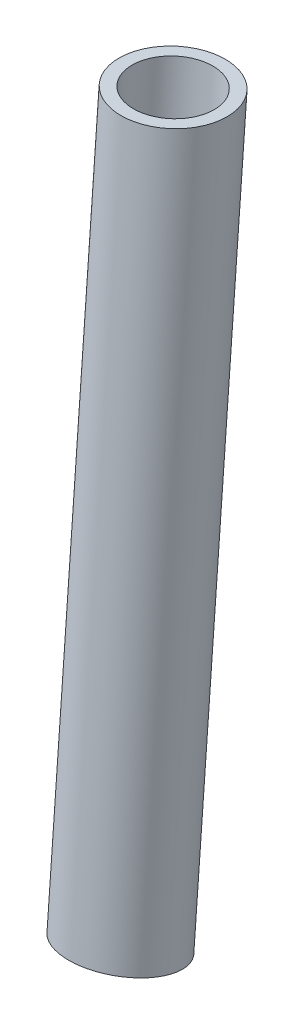
ISO-10303-21;
HEADER;
FILE_DESCRIPTION(('STEP AP214'),'2;1');
FILE_NAME('part.step','',(''),(''),'','','');
FILE_SCHEMA(('AUTOMOTIVE_DESIGN { 1 0 10303 214 1 1 1 1 }'));
ENDSEC;
DATA;
#1=APPLICATION_CONTEXT('core data for automotive mechanical design processes');
#2=APPLICATION_PROTOCOL_DEFINITION('international standard','automotive_design',2000,#1);
#3=PRODUCT_CONTEXT('',#1,'mechanical');
#4=PRODUCT('Part','Part','',(#3));
#5=PRODUCT_RELATED_PRODUCT_CATEGORY('part','',(#4));
#6=PRODUCT_DEFINITION_FORMATION('','',#4);
#7=PRODUCT_DEFINITION_CONTEXT('part definition',#1,'design');
#8=PRODUCT_DEFINITION('design','',#6,#7);
#9=PRODUCT_DEFINITION_SHAPE('','',#8);
#10=(LENGTH_UNIT() NAMED_UNIT(*) SI_UNIT(.MILLI.,.METRE.));
#11=(NAMED_UNIT(*) PLANE_ANGLE_UNIT() SI_UNIT($,.RADIAN.));
#12=(NAMED_UNIT(*) SI_UNIT($,.STERADIAN.) SOLID_ANGLE_UNIT());
#13=UNCERTAINTY_MEASURE_WITH_UNIT(LENGTH_MEASURE(1.E-05),#10,'distance_accuracy_value','');
#14=(GEOMETRIC_REPRESENTATION_CONTEXT(3) GLOBAL_UNCERTAINTY_ASSIGNED_CONTEXT((#13)) GLOBAL_UNIT_ASSIGNED_CONTEXT((#10,
#11,#12)) REPRESENTATION_CONTEXT('',''));
#15=CARTESIAN_POINT('',(0.,0.,0.));
#16=DIRECTION('',(0.,0.,1.));
#17=DIRECTION('',(1.,0.,0.));
#18=AXIS2_PLACEMENT_3D('',#15,#16,#17);
#19=CARTESIAN_POINT('',(899.196916053029,101.086343763392,-238.011921297441));
#20=DIRECTION('',(0.00459360392302388,0.9976356448477,-0.0685712690003063));
#21=DIRECTION('',(0.,0.068571992479684,0.99764617066742));
#22=AXIS2_PLACEMENT_3D('',#19,#20,#21);
#23=CYLINDRICAL_SURFACE('',#22,9.64999999999998);
#24=CARTESIAN_POINT('',(900.,275.499546279119,-249.999999999998));
#25=DIRECTION('',(-0.00229816078025706,-0.999408736415632,0.034305918339809));
#26=DIRECTION('',(0.0668008812398191,-0.0343828093108978,-0.997173738467612));
#27=AXIS2_PLACEMENT_3D('',#24,#25,#26);
#28=ELLIPSE('',#27,9.65570906915421,9.64999999999998);
#29=CARTESIAN_POINT('',(900.645009874815,275.167555875433,-259.628419510043));
#30=VERTEX_POINT('',#29);
#31=EDGE_CURVE('E47',#30,#30,#28,.T.);
#32=ORIENTED_EDGE('',*,*,#31,.F.);
#33=EDGE_LOOP('',(#32));
#34=FACE_BOUND('',#33,.T.);
#35=CARTESIAN_POINT('',(899.196916053029,101.086343763392,-238.011921297441));
#36=DIRECTION('',(0.00143638782424149,-0.977156337317368,0.212516891635755));
#37=DIRECTION('',(0.0414428460712231,0.212392700268517,0.976305193769943));
#38=AXIS2_PLACEMENT_3D('',#35,#36,#37);
#39=ELLIPSE('',#38,9.75326811540499,9.64999999999998);
#40=CARTESIAN_POINT('',(899.601119242227,103.157866714865,-228.48975498014));
#41=VERTEX_POINT('',#40);
#42=EDGE_CURVE('E42',#41,#41,#39,.T.);
#43=ORIENTED_EDGE('',*,*,#42,.T.);
#44=EDGE_LOOP('',(#43));
#45=FACE_BOUND('',#44,.T.);
#46=ADVANCED_FACE('F38',(#34,#45),#23,.F.);
#47=CARTESIAN_POINT('',(899.196916053029,101.086343763392,-238.011921297441));
#48=DIRECTION('',(0.00459360392302388,0.9976356448477,-0.0685712690003063));
#49=DIRECTION('',(0.,0.068571992479684,0.99764617066742));
#50=AXIS2_PLACEMENT_3D('',#47,#48,#49);
#51=CYLINDRICAL_SURFACE('',#50,12.7000000000001);
#52=CARTESIAN_POINT('',(900.,275.499546279119,-249.999999999998));
#53=DIRECTION('',(-0.00229816078025706,-0.999408736415632,0.034305918339809));
#54=DIRECTION('',(0.0668008812398191,-0.0343828093108978,-0.997173738467612));
#55=AXIS2_PLACEMENT_3D('',#52,#53,#54);
#56=ELLIPSE('',#55,12.7075134899751,12.7000000000001);
#57=CARTESIAN_POINT('',(900.848873099497,275.062626265978,-262.671598733424));
#58=VERTEX_POINT('',#57);
#59=EDGE_CURVE('E53',#58,#58,#56,.T.);
#60=ORIENTED_EDGE('',*,*,#59,.T.);
#61=EDGE_LOOP('',(#60));
#62=FACE_BOUND('',#61,.T.);
#63=CARTESIAN_POINT('',(899.196916053029,101.086343763392,-238.011921297441));
#64=DIRECTION('',(0.00143638782424149,-0.977156337317368,0.212516891635755));
#65=DIRECTION('',(0.0414428460712231,0.212392700268517,0.976305193769943));
#66=AXIS2_PLACEMENT_3D('',#63,#64,#65);
#67=ELLIPSE('',#66,12.8359072606885,12.7000000000001);
#68=CARTESIAN_POINT('',(899.728872581818,103.812596766886,-225.480158372081));
#69=VERTEX_POINT('',#68);
#70=EDGE_CURVE('E10',#69,#69,#67,.T.);
#71=ORIENTED_EDGE('',*,*,#70,.F.);
#72=EDGE_LOOP('',(#71));
#73=FACE_BOUND('',#72,.T.);
#74=ADVANCED_FACE('F72',(#62,#73),#51,.T.);
#75=CARTESIAN_POINT('',(899.999999999999,275.499546279119,-249.999999999998));
#76=DIRECTION('',(-0.00229816078025706,-0.999408736415632,0.034305918339809));
#77=DIRECTION('',(0.,-0.0343060089342588,-0.999411375636181));
#78=AXIS2_PLACEMENT_3D('',#75,#76,#77);
#79=PLANE('',#78);
#80=ORIENTED_EDGE('',*,*,#31,.T.);
#81=EDGE_LOOP('',(#80));
#82=FACE_BOUND('',#81,.T.);
#83=ORIENTED_EDGE('',*,*,#59,.F.);
#84=EDGE_LOOP('',(#83));
#85=FACE_BOUND('',#84,.T.);
#86=ADVANCED_FACE('F68',(#82,#85),#79,.F.);
#87=CARTESIAN_POINT('',(899.196916053029,101.086343763392,-238.011921297441));
#88=DIRECTION('',(0.00143638782424149,-0.977156337317368,0.212516891635755));
#89=DIRECTION('',(0.,-0.21251711086958,-0.977157345358283));
#90=AXIS2_PLACEMENT_3D('',#87,#88,#89);
#91=PLANE('',#90);
#92=ORIENTED_EDGE('',*,*,#42,.F.);
#93=EDGE_LOOP('',(#92));
#94=FACE_BOUND('',#93,.T.);
#95=ORIENTED_EDGE('',*,*,#70,.T.);
#96=EDGE_LOOP('',(#95));
#97=FACE_BOUND('',#96,.T.);
#98=ADVANCED_FACE('F40',(#94,#97),#91,.T.);
#99=CLOSED_SHELL('',(#46,#74,#86,#98));
#100=MANIFOLD_SOLID_BREP('B2',#99);
#101=ADVANCED_BREP_SHAPE_REPRESENTATION('',(#18,#100),#14);
#102=SHAPE_DEFINITION_REPRESENTATION(#9,#101);
ENDSEC;
END-ISO-10303-21;
